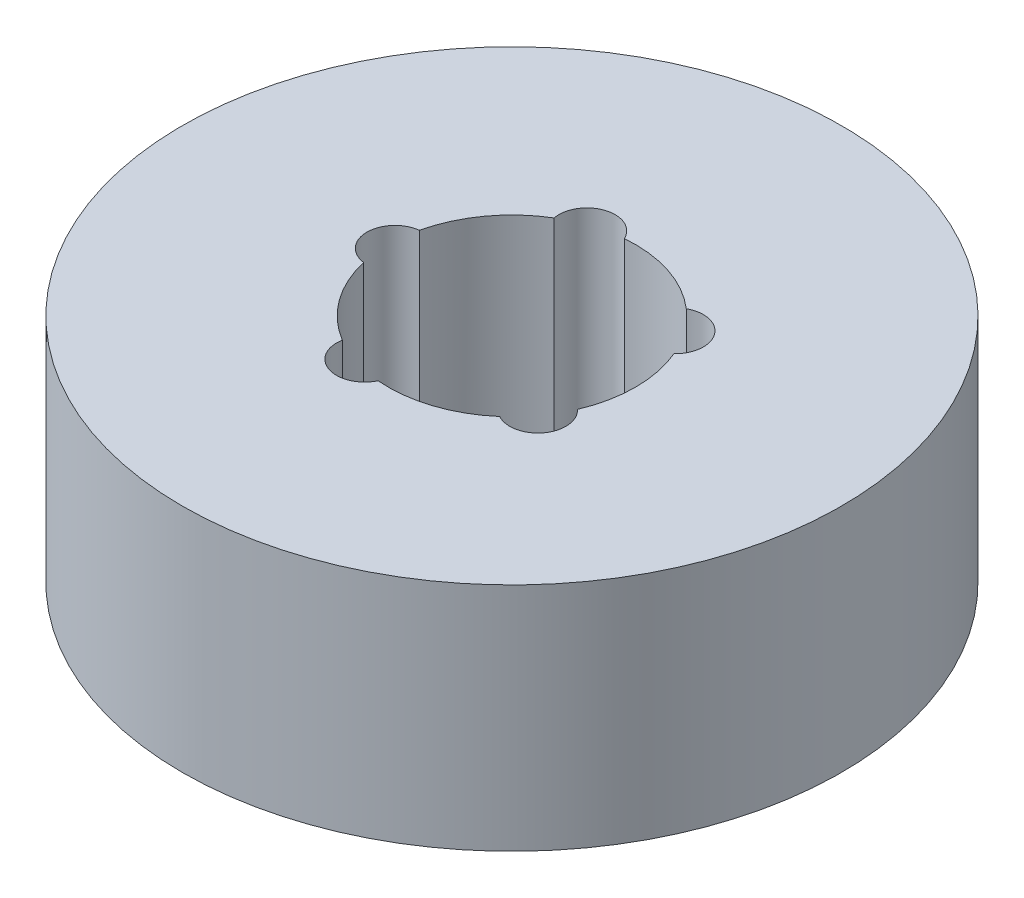
ISO-10303-21;
HEADER;
FILE_DESCRIPTION(('STEP AP214'),'2;1');
FILE_NAME('part.step','',(''),(''),'','','');
FILE_SCHEMA(('AUTOMOTIVE_DESIGN { 1 0 10303 214 1 1 1 1 }'));
ENDSEC;
DATA;
#1=APPLICATION_CONTEXT('core data for automotive mechanical design processes');
#2=APPLICATION_PROTOCOL_DEFINITION('international standard','automotive_design',2000,#1);
#3=PRODUCT_CONTEXT('',#1,'mechanical');
#4=PRODUCT('Part','Part','',(#3));
#5=PRODUCT_RELATED_PRODUCT_CATEGORY('part','',(#4));
#6=PRODUCT_DEFINITION_FORMATION('','',#4);
#7=PRODUCT_DEFINITION_CONTEXT('part definition',#1,'design');
#8=PRODUCT_DEFINITION('design','',#6,#7);
#9=PRODUCT_DEFINITION_SHAPE('','',#8);
#10=(LENGTH_UNIT() NAMED_UNIT(*) SI_UNIT(.MILLI.,.METRE.));
#11=(NAMED_UNIT(*) PLANE_ANGLE_UNIT() SI_UNIT($,.RADIAN.));
#12=(NAMED_UNIT(*) SI_UNIT($,.STERADIAN.) SOLID_ANGLE_UNIT());
#13=UNCERTAINTY_MEASURE_WITH_UNIT(LENGTH_MEASURE(1.E-05),#10,'distance_accuracy_value','');
#14=(GEOMETRIC_REPRESENTATION_CONTEXT(3) GLOBAL_UNCERTAINTY_ASSIGNED_CONTEXT((#13)) GLOBAL_UNIT_ASSIGNED_CONTEXT((#10,
#11,#12)) REPRESENTATION_CONTEXT('',''));
#15=CARTESIAN_POINT('',(0.,0.,0.));
#16=DIRECTION('',(0.,0.,1.));
#17=DIRECTION('',(1.,0.,0.));
#18=AXIS2_PLACEMENT_3D('',#15,#16,#17);
#19=CARTESIAN_POINT('',(0.,28.,0.));
#20=DIRECTION('',(0.,-1.,0.));
#21=DIRECTION('',(0.,0.,-1.));
#22=AXIS2_PLACEMENT_3D('',#19,#20,#21);
#23=CYLINDRICAL_SURFACE('',#22,40.);
#24=CARTESIAN_POINT('',(0.,28.,0.));
#25=DIRECTION('',(0.,1.,0.));
#26=DIRECTION('',(0.,0.,1.));
#27=AXIS2_PLACEMENT_3D('',#24,#25,#26);
#28=CIRCLE('',#27,40.);
#29=CARTESIAN_POINT('',(0.,28.,40.));
#30=VERTEX_POINT('',#29);
#31=EDGE_CURVE('E151',#30,#30,#28,.T.);
#32=ORIENTED_EDGE('',*,*,#31,.F.);
#33=EDGE_LOOP('',(#32));
#34=FACE_BOUND('',#33,.T.);
#35=CARTESIAN_POINT('',(0.,0.,0.));
#36=DIRECTION('',(0.,1.,0.));
#37=DIRECTION('',(0.,0.,1.));
#38=AXIS2_PLACEMENT_3D('',#35,#36,#37);
#39=CIRCLE('',#38,40.);
#40=CARTESIAN_POINT('',(0.,0.,40.));
#41=VERTEX_POINT('',#40);
#42=EDGE_CURVE('E150',#41,#41,#39,.T.);
#43=ORIENTED_EDGE('',*,*,#42,.T.);
#44=EDGE_LOOP('',(#43));
#45=FACE_BOUND('',#44,.T.);
#46=ADVANCED_FACE('F39',(#34,#45),#23,.T.);
#47=CARTESIAN_POINT('',(0.,28.,0.));
#48=DIRECTION('',(0.,1.,0.));
#49=DIRECTION('',(0.,0.,1.));
#50=AXIS2_PLACEMENT_3D('',#47,#48,#49);
#51=PLANE('',#50);
#52=CARTESIAN_POINT('',(-4.38508989388826,28.,-13.495918975453));
#53=DIRECTION('',(0.,1.,0.));
#54=DIRECTION('',(-0.95105651629515,0.,0.309016994374958));
#55=AXIS2_PLACEMENT_3D('',#52,#53,#54);
#56=CIRCLE('',#55,3.41082519460987);
#57=CARTESIAN_POINT('',(-1.29684308956198,28.,-14.9438347823126));
#58=VERTEX_POINT('',#57);
#59=CARTESIAN_POINT('',(-7.73459759924558,28.,-12.8520815426041));
#60=VERTEX_POINT('',#59);
#61=EDGE_CURVE('E196',#58,#60,#56,.T.);
#62=ORIENTED_EDGE('',*,*,#61,.F.);
#63=CARTESIAN_POINT('',(0.,28.,0.));
#64=DIRECTION('',(0.,1.,0.));
#65=DIRECTION('',(0.,0.,1.));
#66=AXIS2_PLACEMENT_3D('',#63,#64,#65);
#67=CIRCLE('',#66,15.);
#68=CARTESIAN_POINT('',(9.83293379623176,28.,-11.3275510574406));
#69=VERTEX_POINT('',#68);
#70=EDGE_CURVE('E156',#69,#58,#67,.T.);
#71=ORIENTED_EDGE('',*,*,#70,.F.);
#72=CARTESIAN_POINT('',(11.4803143859227,28.,-8.34093663624471));
#73=DIRECTION('',(0.,1.,0.));
#74=DIRECTION('',(-0.58778525229248,0.,-0.809016994374942));
#75=AXIS2_PLACEMENT_3D('',#72,#73,#74);
#76=CIRCLE('',#75,3.41082519460987);
#77=CARTESIAN_POINT('',(13.8116848944442,28.,-5.85126997980625));
#78=VERTEX_POINT('',#77);
#79=EDGE_CURVE('E254',#78,#69,#76,.T.);
#80=ORIENTED_EDGE('',*,*,#79,.F.);
#81=CARTESIAN_POINT('',(13.8116848944443,28.,5.85126997980605));
#82=VERTEX_POINT('',#81);
#83=EDGE_CURVE('E153',#82,#78,#67,.T.);
#84=ORIENTED_EDGE('',*,*,#83,.F.);
#85=CARTESIAN_POINT('',(11.4803143859228,28.,8.34093663624455));
#86=DIRECTION('',(0.,1.,0.));
#87=DIRECTION('',(0.587785252292469,0.,-0.809016994374951));
#88=AXIS2_PLACEMENT_3D('',#85,#86,#87);
#89=CIRCLE('',#88,3.41082519460987);
#90=CARTESIAN_POINT('',(9.83293379623192,28.,11.3275510574404));
#91=VERTEX_POINT('',#90);
#92=EDGE_CURVE('E248',#91,#82,#89,.T.);
#93=ORIENTED_EDGE('',*,*,#92,.F.);
#94=CARTESIAN_POINT('',(-1.29684308956176,28.,14.9438347823126));
#95=VERTEX_POINT('',#94);
#96=EDGE_CURVE('E140',#95,#91,#67,.T.);
#97=ORIENTED_EDGE('',*,*,#96,.F.);
#98=CARTESIAN_POINT('',(-4.38508989388807,28.,13.495918975453));
#99=DIRECTION('',(0.,1.,0.));
#100=DIRECTION('',(0.951056516295155,0.,0.309016994374945));
#101=AXIS2_PLACEMENT_3D('',#98,#99,#100);
#102=CIRCLE('',#101,3.41082519460987);
#103=CARTESIAN_POINT('',(-7.7345975992454,28.,12.8520815426042));
#104=VERTEX_POINT('',#103);
#105=EDGE_CURVE('E117',#104,#95,#102,.T.);
#106=ORIENTED_EDGE('',*,*,#105,.F.);
#107=CARTESIAN_POINT('',(-14.6131780018689,28.,3.38452783792594));
#108=VERTEX_POINT('',#107);
#109=EDGE_CURVE('E133',#108,#104,#67,.T.);
#110=ORIENTED_EDGE('',*,*,#109,.F.);
#111=CARTESIAN_POINT('',(-14.1904489840693,28.,0.));
#112=DIRECTION('',(0.,1.,0.));
#113=DIRECTION('',(0.,0.,1.));
#114=AXIS2_PLACEMENT_3D('',#111,#112,#113);
#115=CIRCLE('',#114,3.41082519460987);
#116=CARTESIAN_POINT('',(-14.6131780018689,28.,-3.38452783792594));
#117=VERTEX_POINT('',#116);
#118=EDGE_CURVE('E170',#117,#108,#115,.T.);
#119=ORIENTED_EDGE('',*,*,#118,.F.);
#120=EDGE_CURVE('E149',#60,#117,#67,.T.);
#121=ORIENTED_EDGE('',*,*,#120,.F.);
#122=EDGE_LOOP('',(#62,#71,#80,#84,#93,#97,#106,#110,#119,#121));
#123=FACE_BOUND('',#122,.T.);
#124=ORIENTED_EDGE('',*,*,#31,.T.);
#125=EDGE_LOOP('',(#124));
#126=FACE_BOUND('',#125,.T.);
#127=ADVANCED_FACE('F131',(#123,#126),#51,.T.);
#128=CARTESIAN_POINT('',(0.,0.,0.));
#129=DIRECTION('',(0.,1.,0.));
#130=DIRECTION('',(0.,0.,1.));
#131=AXIS2_PLACEMENT_3D('',#128,#129,#130);
#132=PLANE('',#131);
#133=CARTESIAN_POINT('',(0.,0.,0.));
#134=DIRECTION('',(0.,1.,0.));
#135=DIRECTION('',(0.,0.,1.));
#136=AXIS2_PLACEMENT_3D('',#133,#134,#135);
#137=CIRCLE('',#136,15.);
#138=CARTESIAN_POINT('',(0.,0.,15.));
#139=VERTEX_POINT('',#138);
#140=EDGE_CURVE('E160',#139,#139,#137,.T.);
#141=ORIENTED_EDGE('',*,*,#140,.T.);
#142=EDGE_LOOP('',(#141));
#143=FACE_BOUND('',#142,.T.);
#144=ORIENTED_EDGE('',*,*,#42,.F.);
#145=EDGE_LOOP('',(#144));
#146=FACE_BOUND('',#145,.T.);
#147=ADVANCED_FACE('F212',(#143,#146),#132,.F.);
#148=CARTESIAN_POINT('',(0.,28.,0.));
#149=DIRECTION('',(0.,-1.,0.));
#150=DIRECTION('',(0.,0.,-1.));
#151=AXIS2_PLACEMENT_3D('',#148,#149,#150);
#152=CYLINDRICAL_SURFACE('',#151,15.);
#153=DIRECTION('',(0.,1.,0.));
#154=VECTOR('',#153,1.);
#155=CARTESIAN_POINT('',(-1.29684308956198,16.0500951831453,-14.9438347823126));
#156=LINE('',#155,#154);
#157=CARTESIAN_POINT('',(-1.29684308956198,4.10019036629065,-14.9438347823126));
#158=VERTEX_POINT('',#157);
#159=EDGE_CURVE('E11',#158,#58,#156,.T.);
#160=ORIENTED_EDGE('',*,*,#159,.F.);
#161=CARTESIAN_POINT('',(0.,4.10019036629065,0.));
#162=DIRECTION('',(0.,1.,0.));
#163=DIRECTION('',(0.,0.,1.));
#164=AXIS2_PLACEMENT_3D('',#161,#162,#163);
#165=CIRCLE('',#164,15.);
#166=CARTESIAN_POINT('',(-7.73459759924558,4.10019036629065,-12.8520815426041));
#167=VERTEX_POINT('',#166);
#168=EDGE_CURVE('E193',#158,#167,#165,.T.);
#169=ORIENTED_EDGE('',*,*,#168,.T.);
#170=DIRECTION('',(0.,1.,0.));
#171=VECTOR('',#170,1.);
#172=CARTESIAN_POINT('',(-7.73459759924558,16.0500951831453,-12.8520815426041));
#173=LINE('',#172,#171);
#174=EDGE_CURVE('E46',#60,#167,#173,.F.);
#175=ORIENTED_EDGE('',*,*,#174,.F.);
#176=ORIENTED_EDGE('',*,*,#120,.T.);
#177=DIRECTION('',(0.,1.,0.));
#178=VECTOR('',#177,1.);
#179=CARTESIAN_POINT('',(-14.6131780018689,16.0500951831453,-3.38452783792594));
#180=LINE('',#179,#178);
#181=CARTESIAN_POINT('',(-14.6131780018689,4.10019036629065,-3.38452783792594));
#182=VERTEX_POINT('',#181);
#183=EDGE_CURVE('E174',#182,#117,#180,.T.);
#184=ORIENTED_EDGE('',*,*,#183,.F.);
#185=CARTESIAN_POINT('',(0.,4.10019036629065,0.));
#186=DIRECTION('',(0.,1.,0.));
#187=DIRECTION('',(0.,0.,1.));
#188=AXIS2_PLACEMENT_3D('',#185,#186,#187);
#189=CIRCLE('',#188,15.);
#190=CARTESIAN_POINT('',(-14.6131780018689,4.10019036629065,3.38452783792594));
#191=VERTEX_POINT('',#190);
#192=EDGE_CURVE('E171',#182,#191,#189,.T.);
#193=ORIENTED_EDGE('',*,*,#192,.T.);
#194=DIRECTION('',(0.,1.,0.));
#195=VECTOR('',#194,1.);
#196=CARTESIAN_POINT('',(-14.6131780018689,16.0500951831453,3.38452783792594));
#197=LINE('',#196,#195);
#198=EDGE_CURVE('E148',#108,#191,#197,.F.);
#199=ORIENTED_EDGE('',*,*,#198,.F.);
#200=ORIENTED_EDGE('',*,*,#109,.T.);
#201=DIRECTION('',(0.,1.,0.));
#202=VECTOR('',#201,1.);
#203=CARTESIAN_POINT('',(-7.7345975992454,16.0500951831453,12.8520815426042));
#204=LINE('',#203,#202);
#205=CARTESIAN_POINT('',(-7.7345975992454,4.10019036629065,12.8520815426042));
#206=VERTEX_POINT('',#205);
#207=EDGE_CURVE('E111',#206,#104,#204,.T.);
#208=ORIENTED_EDGE('',*,*,#207,.F.);
#209=CARTESIAN_POINT('',(0.,4.10019036629065,0.));
#210=DIRECTION('',(0.,1.,0.));
#211=DIRECTION('',(0.,0.,1.));
#212=AXIS2_PLACEMENT_3D('',#209,#210,#211);
#213=CIRCLE('',#212,15.);
#214=CARTESIAN_POINT('',(-1.29684308956176,4.10019036629065,14.9438347823126));
#215=VERTEX_POINT('',#214);
#216=EDGE_CURVE('E180',#206,#215,#213,.T.);
#217=ORIENTED_EDGE('',*,*,#216,.T.);
#218=DIRECTION('',(0.,1.,0.));
#219=VECTOR('',#218,1.);
#220=CARTESIAN_POINT('',(-1.29684308956176,16.0500951831453,14.9438347823126));
#221=LINE('',#220,#219);
#222=EDGE_CURVE('E124',#95,#215,#221,.F.);
#223=ORIENTED_EDGE('',*,*,#222,.F.);
#224=ORIENTED_EDGE('',*,*,#96,.T.);
#225=DIRECTION('',(0.,1.,0.));
#226=VECTOR('',#225,1.);
#227=CARTESIAN_POINT('',(9.83293379623192,16.0500951831453,11.3275510574404));
#228=LINE('',#227,#226);
#229=CARTESIAN_POINT('',(9.83293379623192,4.10019036629065,11.3275510574404));
#230=VERTEX_POINT('',#229);
#231=EDGE_CURVE('E183',#230,#91,#228,.T.);
#232=ORIENTED_EDGE('',*,*,#231,.F.);
#233=CARTESIAN_POINT('',(0.,4.10019036629065,0.));
#234=DIRECTION('',(0.,1.,0.));
#235=DIRECTION('',(0.,0.,1.));
#236=AXIS2_PLACEMENT_3D('',#233,#234,#235);
#237=CIRCLE('',#236,15.);
#238=CARTESIAN_POINT('',(13.8116848944443,4.10019036629065,5.85126997980605));
#239=VERTEX_POINT('',#238);
#240=EDGE_CURVE('E123',#230,#239,#237,.T.);
#241=ORIENTED_EDGE('',*,*,#240,.T.);
#242=DIRECTION('',(0.,1.,0.));
#243=VECTOR('',#242,1.);
#244=CARTESIAN_POINT('',(13.8116848944443,16.0500951831453,5.85126997980605));
#245=LINE('',#244,#243);
#246=EDGE_CURVE('E185',#82,#239,#245,.F.);
#247=ORIENTED_EDGE('',*,*,#246,.F.);
#248=ORIENTED_EDGE('',*,*,#83,.T.);
#249=DIRECTION('',(0.,1.,0.));
#250=VECTOR('',#249,1.);
#251=CARTESIAN_POINT('',(13.8116848944442,16.0500951831453,-5.85126997980625));
#252=LINE('',#251,#250);
#253=CARTESIAN_POINT('',(13.8116848944442,4.10019036629065,-5.85126997980625));
#254=VERTEX_POINT('',#253);
#255=EDGE_CURVE('E195',#254,#78,#252,.T.);
#256=ORIENTED_EDGE('',*,*,#255,.F.);
#257=CARTESIAN_POINT('',(0.,4.10019036629065,0.));
#258=DIRECTION('',(0.,1.,0.));
#259=DIRECTION('',(0.,0.,1.));
#260=AXIS2_PLACEMENT_3D('',#257,#258,#259);
#261=CIRCLE('',#260,15.);
#262=CARTESIAN_POINT('',(9.83293379623176,4.10019036629065,-11.3275510574406));
#263=VERTEX_POINT('',#262);
#264=EDGE_CURVE('E190',#254,#263,#261,.T.);
#265=ORIENTED_EDGE('',*,*,#264,.T.);
#266=DIRECTION('',(0.,1.,0.));
#267=VECTOR('',#266,1.);
#268=CARTESIAN_POINT('',(9.83293379623176,16.0500951831453,-11.3275510574406));
#269=LINE('',#268,#267);
#270=EDGE_CURVE('E189',#69,#263,#269,.F.);
#271=ORIENTED_EDGE('',*,*,#270,.F.);
#272=ORIENTED_EDGE('',*,*,#70,.T.);
#273=EDGE_LOOP('',(#160,#169,#175,#176,#184,#193,#199,#200,#208,#217,#223,#224,#232,#241,#247,
#248,#256,#265,#271,#272));
#274=FACE_BOUND('',#273,.T.);
#275=ORIENTED_EDGE('',*,*,#140,.F.);
#276=EDGE_LOOP('',(#275));
#277=FACE_BOUND('',#276,.T.);
#278=ADVANCED_FACE('F142',(#274,#277),#152,.F.);
#279=CARTESIAN_POINT('',(-14.1904489840693,4.10019036629065,0.));
#280=DIRECTION('',(0.,1.,0.));
#281=DIRECTION('',(0.,0.,1.));
#282=AXIS2_PLACEMENT_3D('',#279,#280,#281);
#283=CYLINDRICAL_SURFACE('',#282,3.41082519460987);
#284=ORIENTED_EDGE('',*,*,#183,.T.);
#285=ORIENTED_EDGE('',*,*,#118,.T.);
#286=ORIENTED_EDGE('',*,*,#198,.T.);
#287=CARTESIAN_POINT('',(-14.1904489840693,4.10019036629065,0.));
#288=DIRECTION('',(0.,1.,0.));
#289=DIRECTION('',(0.,0.,1.));
#290=AXIS2_PLACEMENT_3D('',#287,#288,#289);
#291=CIRCLE('',#290,3.41082519460987);
#292=EDGE_CURVE('E163',#182,#191,#291,.T.);
#293=ORIENTED_EDGE('',*,*,#292,.F.);
#294=EDGE_LOOP('',(#284,#285,#286,#293));
#295=FACE_BOUND('',#294,.T.);
#296=ADVANCED_FACE('F221',(#295),#283,.F.);
#297=CARTESIAN_POINT('',(-14.1904489840693,4.10019036629065,0.));
#298=DIRECTION('',(0.,1.,0.));
#299=DIRECTION('',(0.,0.,1.));
#300=AXIS2_PLACEMENT_3D('',#297,#298,#299);
#301=PLANE('',#300);
#302=ORIENTED_EDGE('',*,*,#292,.T.);
#303=ORIENTED_EDGE('',*,*,#192,.F.);
#304=EDGE_LOOP('',(#302,#303));
#305=FACE_BOUND('',#304,.T.);
#306=ADVANCED_FACE('F227',(#305),#301,.T.);
#307=CARTESIAN_POINT('',(-4.38508989388807,4.10019036629065,13.495918975453));
#308=DIRECTION('',(0.,1.,0.));
#309=DIRECTION('',(0.,0.,1.));
#310=AXIS2_PLACEMENT_3D('',#307,#308,#309);
#311=CYLINDRICAL_SURFACE('',#310,3.41082519460987);
#312=ORIENTED_EDGE('',*,*,#207,.T.);
#313=ORIENTED_EDGE('',*,*,#105,.T.);
#314=ORIENTED_EDGE('',*,*,#222,.T.);
#315=CARTESIAN_POINT('',(-4.38508989388807,4.10019036629065,13.495918975453));
#316=DIRECTION('',(0.,1.,0.));
#317=DIRECTION('',(0.951056516295155,0.,0.309016994374945));
#318=AXIS2_PLACEMENT_3D('',#315,#316,#317);
#319=CIRCLE('',#318,3.41082519460987);
#320=EDGE_CURVE('E119',#206,#215,#319,.T.);
#321=ORIENTED_EDGE('',*,*,#320,.F.);
#322=EDGE_LOOP('',(#312,#313,#314,#321));
#323=FACE_BOUND('',#322,.T.);
#324=ADVANCED_FACE('F116',(#323),#311,.F.);
#325=CARTESIAN_POINT('',(-4.38508989388807,4.10019036629065,13.495918975453));
#326=DIRECTION('',(0.,1.,0.));
#327=DIRECTION('',(0.951056516295155,0.,0.309016994374945));
#328=AXIS2_PLACEMENT_3D('',#325,#326,#327);
#329=PLANE('',#328);
#330=ORIENTED_EDGE('',*,*,#320,.T.);
#331=ORIENTED_EDGE('',*,*,#216,.F.);
#332=EDGE_LOOP('',(#330,#331));
#333=FACE_BOUND('',#332,.T.);
#334=ADVANCED_FACE('F234',(#333),#329,.T.);
#335=CARTESIAN_POINT('',(11.4803143859228,4.10019036629065,8.34093663624455));
#336=DIRECTION('',(0.,1.,0.));
#337=DIRECTION('',(0.,0.,1.));
#338=AXIS2_PLACEMENT_3D('',#335,#336,#337);
#339=CYLINDRICAL_SURFACE('',#338,3.41082519460987);
#340=ORIENTED_EDGE('',*,*,#231,.T.);
#341=ORIENTED_EDGE('',*,*,#92,.T.);
#342=ORIENTED_EDGE('',*,*,#246,.T.);
#343=CARTESIAN_POINT('',(11.4803143859228,4.10019036629065,8.34093663624455));
#344=DIRECTION('',(0.,1.,0.));
#345=DIRECTION('',(0.587785252292469,0.,-0.809016994374951));
#346=AXIS2_PLACEMENT_3D('',#343,#344,#345);
#347=CIRCLE('',#346,3.41082519460987);
#348=EDGE_CURVE('E137',#230,#239,#347,.T.);
#349=ORIENTED_EDGE('',*,*,#348,.F.);
#350=EDGE_LOOP('',(#340,#341,#342,#349));
#351=FACE_BOUND('',#350,.T.);
#352=ADVANCED_FACE('F240',(#351),#339,.F.);
#353=CARTESIAN_POINT('',(11.4803143859228,4.10019036629065,8.34093663624455));
#354=DIRECTION('',(0.,1.,0.));
#355=DIRECTION('',(0.587785252292469,0.,-0.809016994374951));
#356=AXIS2_PLACEMENT_3D('',#353,#354,#355);
#357=PLANE('',#356);
#358=ORIENTED_EDGE('',*,*,#348,.T.);
#359=ORIENTED_EDGE('',*,*,#240,.F.);
#360=EDGE_LOOP('',(#358,#359));
#361=FACE_BOUND('',#360,.T.);
#362=ADVANCED_FACE('F245',(#361),#357,.T.);
#363=CARTESIAN_POINT('',(11.4803143859227,4.10019036629065,-8.34093663624471));
#364=DIRECTION('',(0.,1.,0.));
#365=DIRECTION('',(0.,0.,1.));
#366=AXIS2_PLACEMENT_3D('',#363,#364,#365);
#367=CYLINDRICAL_SURFACE('',#366,3.41082519460987);
#368=ORIENTED_EDGE('',*,*,#255,.T.);
#369=ORIENTED_EDGE('',*,*,#79,.T.);
#370=ORIENTED_EDGE('',*,*,#270,.T.);
#371=CARTESIAN_POINT('',(11.4803143859227,4.10019036629065,-8.34093663624471));
#372=DIRECTION('',(0.,1.,0.));
#373=DIRECTION('',(-0.58778525229248,0.,-0.809016994374942));
#374=AXIS2_PLACEMENT_3D('',#371,#372,#373);
#375=CIRCLE('',#374,3.41082519460987);
#376=EDGE_CURVE('E56',#254,#263,#375,.T.);
#377=ORIENTED_EDGE('',*,*,#376,.F.);
#378=EDGE_LOOP('',(#368,#369,#370,#377));
#379=FACE_BOUND('',#378,.T.);
#380=ADVANCED_FACE('F264',(#379),#367,.F.);
#381=CARTESIAN_POINT('',(11.4803143859227,4.10019036629065,-8.34093663624471));
#382=DIRECTION('',(0.,1.,0.));
#383=DIRECTION('',(-0.58778525229248,0.,-0.809016994374942));
#384=AXIS2_PLACEMENT_3D('',#381,#382,#383);
#385=PLANE('',#384);
#386=ORIENTED_EDGE('',*,*,#376,.T.);
#387=ORIENTED_EDGE('',*,*,#264,.F.);
#388=EDGE_LOOP('',(#386,#387));
#389=FACE_BOUND('',#388,.T.);
#390=ADVANCED_FACE('F202',(#389),#385,.T.);
#391=CARTESIAN_POINT('',(-4.38508989388826,4.10019036629065,-13.495918975453));
#392=DIRECTION('',(0.,1.,0.));
#393=DIRECTION('',(0.,0.,1.));
#394=AXIS2_PLACEMENT_3D('',#391,#392,#393);
#395=CYLINDRICAL_SURFACE('',#394,3.41082519460987);
#396=ORIENTED_EDGE('',*,*,#159,.T.);
#397=ORIENTED_EDGE('',*,*,#61,.T.);
#398=ORIENTED_EDGE('',*,*,#174,.T.);
#399=CARTESIAN_POINT('',(-4.38508989388826,4.10019036629065,-13.495918975453));
#400=DIRECTION('',(0.,1.,0.));
#401=DIRECTION('',(-0.95105651629515,0.,0.309016994374958));
#402=AXIS2_PLACEMENT_3D('',#399,#400,#401);
#403=CIRCLE('',#402,3.41082519460987);
#404=EDGE_CURVE('E55',#158,#167,#403,.T.);
#405=ORIENTED_EDGE('',*,*,#404,.F.);
#406=EDGE_LOOP('',(#396,#397,#398,#405));
#407=FACE_BOUND('',#406,.T.);
#408=ADVANCED_FACE('F197',(#407),#395,.F.);
#409=CARTESIAN_POINT('',(-4.38508989388826,4.10019036629065,-13.495918975453));
#410=DIRECTION('',(0.,1.,0.));
#411=DIRECTION('',(-0.95105651629515,0.,0.309016994374958));
#412=AXIS2_PLACEMENT_3D('',#409,#410,#411);
#413=PLANE('',#412);
#414=ORIENTED_EDGE('',*,*,#404,.T.);
#415=ORIENTED_EDGE('',*,*,#168,.F.);
#416=EDGE_LOOP('',(#414,#415));
#417=FACE_BOUND('',#416,.T.);
#418=ADVANCED_FACE('F200',(#417),#413,.T.);
#419=CLOSED_SHELL('',(#46,#127,#147,#278,#296,#306,#324,#334,#352,#362,#380,#390,#408,#418));
#420=MANIFOLD_SOLID_BREP('B2',#419);
#421=ADVANCED_BREP_SHAPE_REPRESENTATION('',(#18,#420),#14);
#422=SHAPE_DEFINITION_REPRESENTATION(#9,#421);
ENDSEC;
END-ISO-10303-21;
